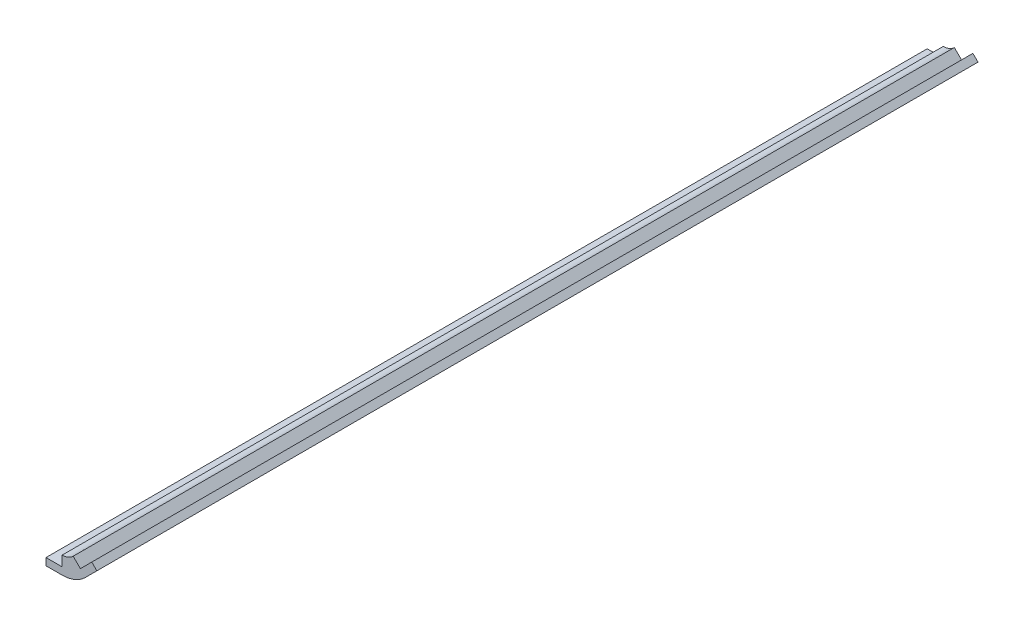
ISO-10303-21;
HEADER;
FILE_DESCRIPTION(('STEP AP214'),'2;1');
FILE_NAME('part.step','',(''),(''),'','','');
FILE_SCHEMA(('AUTOMOTIVE_DESIGN { 1 0 10303 214 1 1 1 1 }'));
ENDSEC;
DATA;
#1=APPLICATION_CONTEXT('core data for automotive mechanical design processes');
#2=APPLICATION_PROTOCOL_DEFINITION('international standard','automotive_design',2000,#1);
#3=PRODUCT_CONTEXT('',#1,'mechanical');
#4=PRODUCT('Part','Part','',(#3));
#5=PRODUCT_RELATED_PRODUCT_CATEGORY('part','',(#4));
#6=PRODUCT_DEFINITION_FORMATION('','',#4);
#7=PRODUCT_DEFINITION_CONTEXT('part definition',#1,'design');
#8=PRODUCT_DEFINITION('design','',#6,#7);
#9=PRODUCT_DEFINITION_SHAPE('','',#8);
#10=(LENGTH_UNIT() NAMED_UNIT(*) SI_UNIT(.MILLI.,.METRE.));
#11=(NAMED_UNIT(*) PLANE_ANGLE_UNIT() SI_UNIT($,.RADIAN.));
#12=(NAMED_UNIT(*) SI_UNIT($,.STERADIAN.) SOLID_ANGLE_UNIT());
#13=UNCERTAINTY_MEASURE_WITH_UNIT(LENGTH_MEASURE(1.E-05),#10,'distance_accuracy_value','');
#14=(GEOMETRIC_REPRESENTATION_CONTEXT(3) GLOBAL_UNCERTAINTY_ASSIGNED_CONTEXT((#13)) GLOBAL_UNIT_ASSIGNED_CONTEXT((#10,
#11,#12)) REPRESENTATION_CONTEXT('',''));
#15=CARTESIAN_POINT('',(0.,0.,0.));
#16=DIRECTION('',(0.,0.,1.));
#17=DIRECTION('',(1.,0.,0.));
#18=AXIS2_PLACEMENT_3D('',#15,#16,#17);
#19=CARTESIAN_POINT('',(-7.3025,-1.500000048,130.175));
#20=DIRECTION('',(1.,0.,0.));
#21=DIRECTION('',(0.,0.,-1.));
#22=AXIS2_PLACEMENT_3D('',#19,#20,#21);
#23=PLANE('',#22);
#24=DIRECTION('',(0.,-1.,0.));
#25=VECTOR('',#24,1.);
#26=CARTESIAN_POINT('',(-7.3025,-1.500000048,-130.175));
#27=LINE('',#26,#25);
#28=CARTESIAN_POINT('',(-7.3025,-1.500000048,-130.175));
#29=VERTEX_POINT('',#28);
#30=CARTESIAN_POINT('',(-7.3025,-3.621225168,-130.175));
#31=VERTEX_POINT('',#30);
#32=EDGE_CURVE('E94',#29,#31,#27,.T.);
#33=ORIENTED_EDGE('',*,*,#32,.T.);
#34=DIRECTION('',(0.,0.,-1.));
#35=VECTOR('',#34,1.);
#36=CARTESIAN_POINT('',(-7.3025,-3.621225168,130.175));
#37=LINE('',#36,#35);
#38=CARTESIAN_POINT('',(-7.3025,-3.621225168,130.175));
#39=VERTEX_POINT('',#38);
#40=EDGE_CURVE('E11',#39,#31,#37,.T.);
#41=ORIENTED_EDGE('',*,*,#40,.F.);
#42=DIRECTION('',(0.,-1.,0.));
#43=VECTOR('',#42,1.);
#44=CARTESIAN_POINT('',(-7.3025,-1.500000048,130.175));
#45=LINE('',#44,#43);
#46=CARTESIAN_POINT('',(-7.3025,-1.500000048,130.175));
#47=VERTEX_POINT('',#46);
#48=EDGE_CURVE('E88',#47,#39,#45,.T.);
#49=ORIENTED_EDGE('',*,*,#48,.F.);
#50=DIRECTION('',(0.,0.,-1.));
#51=VECTOR('',#50,1.);
#52=CARTESIAN_POINT('',(-7.3025,-1.500000048,130.175));
#53=LINE('',#52,#51);
#54=EDGE_CURVE('E83',#47,#29,#53,.T.);
#55=ORIENTED_EDGE('',*,*,#54,.T.);
#56=EDGE_LOOP('',(#33,#41,#49,#55));
#57=FACE_BOUND('',#56,.T.);
#58=ADVANCED_FACE('F40',(#57),#23,.F.);
#59=CARTESIAN_POINT('',(-7.3025,-3.621225168,130.175));
#60=DIRECTION('',(0.,1.,0.));
#61=DIRECTION('',(0.,0.,1.));
#62=AXIS2_PLACEMENT_3D('',#59,#60,#61);
#63=PLANE('',#62);
#64=DIRECTION('',(1.,0.,0.));
#65=VECTOR('',#64,1.);
#66=CARTESIAN_POINT('',(-7.3025,-3.621225168,-130.175));
#67=LINE('',#66,#65);
#68=CARTESIAN_POINT('',(-2.54,-3.621225168,-130.175));
#69=VERTEX_POINT('',#68);
#70=EDGE_CURVE('E89',#31,#69,#67,.T.);
#71=ORIENTED_EDGE('',*,*,#70,.T.);
#72=DIRECTION('',(0.,0.,-1.));
#73=VECTOR('',#72,1.);
#74=CARTESIAN_POINT('',(-2.54,-3.621225168,130.175));
#75=LINE('',#74,#73);
#76=CARTESIAN_POINT('',(-2.54,-3.621225168,130.175));
#77=VERTEX_POINT('',#76);
#78=EDGE_CURVE('E49',#77,#69,#75,.T.);
#79=ORIENTED_EDGE('',*,*,#78,.F.);
#80=DIRECTION('',(1.,0.,0.));
#81=VECTOR('',#80,1.);
#82=CARTESIAN_POINT('',(-7.3025,-3.621225168,130.175));
#83=LINE('',#82,#81);
#84=EDGE_CURVE('E137',#39,#77,#83,.T.);
#85=ORIENTED_EDGE('',*,*,#84,.F.);
#86=ORIENTED_EDGE('',*,*,#40,.T.);
#87=EDGE_LOOP('',(#71,#79,#85,#86));
#88=FACE_BOUND('',#87,.T.);
#89=ADVANCED_FACE('F136',(#88),#63,.F.);
#90=CARTESIAN_POINT('',(-7.3025,-1.500000048,130.175));
#91=DIRECTION('',(0.,-1.,0.));
#92=DIRECTION('',(1.,0.,0.));
#93=AXIS2_PLACEMENT_3D('',#90,#91,#92);
#94=PLANE('',#93);
#95=DIRECTION('',(-1.,0.,0.));
#96=VECTOR('',#95,1.);
#97=CARTESIAN_POINT('',(-7.3025,-1.500000048,-130.175));
#98=LINE('',#97,#96);
#99=CARTESIAN_POINT('',(-2.54,-1.500000048,-130.175));
#100=VERTEX_POINT('',#99);
#101=EDGE_CURVE('E80',#100,#29,#98,.T.);
#102=ORIENTED_EDGE('',*,*,#101,.T.);
#103=ORIENTED_EDGE('',*,*,#54,.F.);
#104=DIRECTION('',(-1.,0.,0.));
#105=VECTOR('',#104,1.);
#106=CARTESIAN_POINT('',(-7.3025,-1.500000048,130.175));
#107=LINE('',#106,#105);
#108=CARTESIAN_POINT('',(-2.54,-1.500000048,130.175));
#109=VERTEX_POINT('',#108);
#110=EDGE_CURVE('E60',#109,#47,#107,.T.);
#111=ORIENTED_EDGE('',*,*,#110,.F.);
#112=DIRECTION('',(0.,0.,-1.));
#113=VECTOR('',#112,1.);
#114=CARTESIAN_POINT('',(-2.54,-1.500000048,130.175));
#115=LINE('',#114,#113);
#116=EDGE_CURVE('E85',#109,#100,#115,.T.);
#117=ORIENTED_EDGE('',*,*,#116,.T.);
#118=EDGE_LOOP('',(#102,#103,#111,#117));
#119=FACE_BOUND('',#118,.T.);
#120=ADVANCED_FACE('F82',(#119),#94,.F.);
#121=CARTESIAN_POINT('',(0.,0.,130.175));
#122=DIRECTION('',(0.,0.,1.));
#123=DIRECTION('',(1.,0.,0.));
#124=AXIS2_PLACEMENT_3D('',#121,#122,#123);
#125=PLANE('',#124);
#126=DIRECTION('',(-0.707106781186546,-0.707106781186549,0.));
#127=VECTOR('',#126,1.);
#128=CARTESIAN_POINT('',(6.2243074753357,4.10298706389383,130.175));
#129=LINE('',#128,#127);
#130=CARTESIAN_POINT('',(6.2243074753357,4.10298706389383,130.175));
#131=VERTEX_POINT('',#130);
#132=CARTESIAN_POINT('',(2.85671142993478,0.73539101849289,130.175));
#133=VERTEX_POINT('',#132);
#134=EDGE_CURVE('E180',#131,#133,#129,.T.);
#135=ORIENTED_EDGE('',*,*,#134,.T.);
#136=DIRECTION('',(-0.707106781186549,0.707106781186546,0.));
#137=VECTOR('',#136,1.);
#138=CARTESIAN_POINT('',(2.85671142993478,0.73539101849289,130.175));
#139=LINE('',#138,#137);
#140=CARTESIAN_POINT('',(0.735391018492879,2.85671142993478,130.175));
#141=VERTEX_POINT('',#140);
#142=EDGE_CURVE('E161',#133,#141,#139,.T.);
#143=ORIENTED_EDGE('',*,*,#142,.T.);
#144=CARTESIAN_POINT('',(-2.54,6.13210244842764,130.175));
#145=DIRECTION('',(0.,0.,-1.));
#146=DIRECTION('',(-1.,0.,0.));
#147=AXIS2_PLACEMENT_3D('',#144,#145,#146);
#148=CIRCLE('',#147,4.63210240042764);
#149=CARTESIAN_POINT('',(-2.54,1.500000048,130.175));
#150=VERTEX_POINT('',#149);
#151=EDGE_CURVE('E165',#141,#150,#148,.T.);
#152=ORIENTED_EDGE('',*,*,#151,.T.);
#153=DIRECTION('',(0.,-1.,0.));
#154=VECTOR('',#153,1.);
#155=CARTESIAN_POINT('',(-2.54,1.500000048,130.175));
#156=LINE('',#155,#154);
#157=EDGE_CURVE('E193',#150,#109,#156,.T.);
#158=ORIENTED_EDGE('',*,*,#157,.T.);
#159=ORIENTED_EDGE('',*,*,#110,.T.);
#160=ORIENTED_EDGE('',*,*,#48,.T.);
#161=ORIENTED_EDGE('',*,*,#84,.T.);
#162=CARTESIAN_POINT('',(-2.54,6.13210244842764,130.175));
#163=DIRECTION('',(0.,0.,1.));
#164=DIRECTION('',(-1.,0.,0.));
#165=AXIS2_PLACEMENT_3D('',#162,#163,#164);
#166=CIRCLE('',#165,9.75332761642764);
#167=CARTESIAN_POINT('',(4.35664409671002,-0.764541648282356,130.175));
#168=VERTEX_POINT('',#167);
#169=EDGE_CURVE('E127',#77,#168,#166,.T.);
#170=ORIENTED_EDGE('',*,*,#169,.T.);
#171=DIRECTION('',(0.707106781186546,0.707106781186549,0.));
#172=VECTOR('',#171,1.);
#173=CARTESIAN_POINT('',(7.72424014211095,2.60305439711859,130.175));
#174=LINE('',#173,#172);
#175=CARTESIAN_POINT('',(7.72424014211095,2.60305439711859,130.175));
#176=VERTEX_POINT('',#175);
#177=EDGE_CURVE('E187',#168,#176,#174,.T.);
#178=ORIENTED_EDGE('',*,*,#177,.T.);
#179=DIRECTION('',(-0.707106781186549,0.707106781186546,0.));
#180=VECTOR('',#179,1.);
#181=CARTESIAN_POINT('',(7.72424014211095,2.60305439711859,130.175));
#182=LINE('',#181,#180);
#183=EDGE_CURVE('E183',#176,#131,#182,.T.);
#184=ORIENTED_EDGE('',*,*,#183,.T.);
#185=EDGE_LOOP('',(#135,#143,#152,#158,#159,#160,#161,#170,#178,#184));
#186=FACE_BOUND('',#185,.T.);
#187=ADVANCED_FACE('F140',(#186),#125,.T.);
#188=CARTESIAN_POINT('',(0.,0.,-130.175));
#189=DIRECTION('',(0.,0.,1.));
#190=DIRECTION('',(1.,0.,0.));
#191=AXIS2_PLACEMENT_3D('',#188,#189,#190);
#192=PLANE('',#191);
#193=DIRECTION('',(0.707106781186546,0.707106781186549,0.));
#194=VECTOR('',#193,1.);
#195=CARTESIAN_POINT('',(7.72424014211095,2.60305439711859,-130.175));
#196=LINE('',#195,#194);
#197=CARTESIAN_POINT('',(4.35664409671002,-0.764541648282356,-130.175));
#198=VERTEX_POINT('',#197);
#199=CARTESIAN_POINT('',(7.72424014211095,2.60305439711859,-130.175));
#200=VERTEX_POINT('',#199);
#201=EDGE_CURVE('E134',#198,#200,#196,.T.);
#202=ORIENTED_EDGE('',*,*,#201,.F.);
#203=CARTESIAN_POINT('',(-2.54,6.13210244842764,-130.175));
#204=DIRECTION('',(0.,0.,1.));
#205=DIRECTION('',(-1.,0.,0.));
#206=AXIS2_PLACEMENT_3D('',#203,#204,#205);
#207=CIRCLE('',#206,9.75332761642764);
#208=EDGE_CURVE('E123',#69,#198,#207,.T.);
#209=ORIENTED_EDGE('',*,*,#208,.F.);
#210=ORIENTED_EDGE('',*,*,#70,.F.);
#211=ORIENTED_EDGE('',*,*,#32,.F.);
#212=ORIENTED_EDGE('',*,*,#101,.F.);
#213=DIRECTION('',(0.,-1.,0.));
#214=VECTOR('',#213,1.);
#215=CARTESIAN_POINT('',(-2.54,1.500000048,-130.175));
#216=LINE('',#215,#214);
#217=CARTESIAN_POINT('',(-2.54,1.500000048,-130.175));
#218=VERTEX_POINT('',#217);
#219=EDGE_CURVE('E75',#218,#100,#216,.T.);
#220=ORIENTED_EDGE('',*,*,#219,.F.);
#221=CARTESIAN_POINT('',(-2.54,6.13210244842764,-130.175));
#222=DIRECTION('',(0.,0.,-1.));
#223=DIRECTION('',(-1.,0.,0.));
#224=AXIS2_PLACEMENT_3D('',#221,#222,#223);
#225=CIRCLE('',#224,4.63210240042764);
#226=CARTESIAN_POINT('',(0.735391018492879,2.85671142993478,-130.175));
#227=VERTEX_POINT('',#226);
#228=EDGE_CURVE('E174',#227,#218,#225,.T.);
#229=ORIENTED_EDGE('',*,*,#228,.F.);
#230=DIRECTION('',(-0.707106781186549,0.707106781186546,0.));
#231=VECTOR('',#230,1.);
#232=CARTESIAN_POINT('',(2.85671142993478,0.73539101849289,-130.175));
#233=LINE('',#232,#231);
#234=CARTESIAN_POINT('',(2.85671142993478,0.73539101849289,-130.175));
#235=VERTEX_POINT('',#234);
#236=EDGE_CURVE('E162',#235,#227,#233,.T.);
#237=ORIENTED_EDGE('',*,*,#236,.F.);
#238=DIRECTION('',(-0.707106781186546,-0.707106781186549,0.));
#239=VECTOR('',#238,1.);
#240=CARTESIAN_POINT('',(6.2243074753357,4.10298706389383,-130.175));
#241=LINE('',#240,#239);
#242=CARTESIAN_POINT('',(6.2243074753357,4.10298706389383,-130.175));
#243=VERTEX_POINT('',#242);
#244=EDGE_CURVE('E166',#243,#235,#241,.T.);
#245=ORIENTED_EDGE('',*,*,#244,.F.);
#246=DIRECTION('',(-0.707106781186549,0.707106781186546,0.));
#247=VECTOR('',#246,1.);
#248=CARTESIAN_POINT('',(7.72424014211095,2.60305439711859,-130.175));
#249=LINE('',#248,#247);
#250=EDGE_CURVE('E169',#200,#243,#249,.T.);
#251=ORIENTED_EDGE('',*,*,#250,.F.);
#252=EDGE_LOOP('',(#202,#209,#210,#211,#212,#220,#229,#237,#245,#251));
#253=FACE_BOUND('',#252,.T.);
#254=ADVANCED_FACE('F98',(#253),#192,.F.);
#255=CARTESIAN_POINT('',(-2.54,6.13210244842764,130.175));
#256=DIRECTION('',(0.,0.,-1.));
#257=DIRECTION('',(-1.,0.,0.));
#258=AXIS2_PLACEMENT_3D('',#255,#256,#257);
#259=CYLINDRICAL_SURFACE('',#258,4.63210240042764);
#260=ORIENTED_EDGE('',*,*,#228,.T.);
#261=DIRECTION('',(0.,0.,-1.));
#262=VECTOR('',#261,1.);
#263=CARTESIAN_POINT('',(-2.54,1.500000048,130.175));
#264=LINE('',#263,#262);
#265=EDGE_CURVE('E101',#150,#218,#264,.T.);
#266=ORIENTED_EDGE('',*,*,#265,.F.);
#267=ORIENTED_EDGE('',*,*,#151,.F.);
#268=DIRECTION('',(0.,0.,-1.));
#269=VECTOR('',#268,1.);
#270=CARTESIAN_POINT('',(0.735391018492879,2.85671142993478,130.175));
#271=LINE('',#270,#269);
#272=EDGE_CURVE('E157',#141,#227,#271,.T.);
#273=ORIENTED_EDGE('',*,*,#272,.T.);
#274=EDGE_LOOP('',(#260,#266,#267,#273));
#275=FACE_BOUND('',#274,.T.);
#276=ADVANCED_FACE('F208',(#275),#259,.F.);
#277=CARTESIAN_POINT('',(-2.54,1.500000048,130.175));
#278=DIRECTION('',(1.,0.,0.));
#279=DIRECTION('',(0.,0.,-1.));
#280=AXIS2_PLACEMENT_3D('',#277,#278,#279);
#281=PLANE('',#280);
#282=ORIENTED_EDGE('',*,*,#219,.T.);
#283=ORIENTED_EDGE('',*,*,#116,.F.);
#284=ORIENTED_EDGE('',*,*,#157,.F.);
#285=ORIENTED_EDGE('',*,*,#265,.T.);
#286=EDGE_LOOP('',(#282,#283,#284,#285));
#287=FACE_BOUND('',#286,.T.);
#288=ADVANCED_FACE('F210',(#287),#281,.F.);
#289=CARTESIAN_POINT('',(-2.54,6.13210244842764,130.175));
#290=DIRECTION('',(0.,0.,-1.));
#291=DIRECTION('',(-1.,0.,0.));
#292=AXIS2_PLACEMENT_3D('',#289,#290,#291);
#293=CYLINDRICAL_SURFACE('',#292,9.75332761642764);
#294=ORIENTED_EDGE('',*,*,#208,.T.);
#295=DIRECTION('',(0.,0.,-1.));
#296=VECTOR('',#295,1.);
#297=CARTESIAN_POINT('',(4.35664409671002,-0.764541648282356,130.175));
#298=LINE('',#297,#296);
#299=EDGE_CURVE('E105',#168,#198,#298,.T.);
#300=ORIENTED_EDGE('',*,*,#299,.F.);
#301=ORIENTED_EDGE('',*,*,#169,.F.);
#302=ORIENTED_EDGE('',*,*,#78,.T.);
#303=EDGE_LOOP('',(#294,#300,#301,#302));
#304=FACE_BOUND('',#303,.T.);
#305=ADVANCED_FACE('F120',(#304),#293,.T.);
#306=CARTESIAN_POINT('',(7.72424014211095,2.60305439711859,130.175));
#307=DIRECTION('',(-0.707106781186549,0.707106781186546,0.));
#308=DIRECTION('',(-0.707106781186546,-0.707106781186549,0.));
#309=AXIS2_PLACEMENT_3D('',#306,#307,#308);
#310=PLANE('',#309);
#311=ORIENTED_EDGE('',*,*,#201,.T.);
#312=DIRECTION('',(0.,0.,-1.));
#313=VECTOR('',#312,1.);
#314=CARTESIAN_POINT('',(7.72424014211095,2.60305439711859,130.175));
#315=LINE('',#314,#313);
#316=EDGE_CURVE('E146',#176,#200,#315,.T.);
#317=ORIENTED_EDGE('',*,*,#316,.F.);
#318=ORIENTED_EDGE('',*,*,#177,.F.);
#319=ORIENTED_EDGE('',*,*,#299,.T.);
#320=EDGE_LOOP('',(#311,#317,#318,#319));
#321=FACE_BOUND('',#320,.T.);
#322=ADVANCED_FACE('F251',(#321),#310,.F.);
#323=CARTESIAN_POINT('',(7.72424014211095,2.60305439711859,130.175));
#324=DIRECTION('',(-0.707106781186546,-0.707106781186549,0.));
#325=DIRECTION('',(0.707106781186549,-0.707106781186546,0.));
#326=AXIS2_PLACEMENT_3D('',#323,#324,#325);
#327=PLANE('',#326);
#328=ORIENTED_EDGE('',*,*,#250,.T.);
#329=DIRECTION('',(0.,0.,-1.));
#330=VECTOR('',#329,1.);
#331=CARTESIAN_POINT('',(6.2243074753357,4.10298706389383,130.175));
#332=LINE('',#331,#330);
#333=EDGE_CURVE('E149',#131,#243,#332,.T.);
#334=ORIENTED_EDGE('',*,*,#333,.F.);
#335=ORIENTED_EDGE('',*,*,#183,.F.);
#336=ORIENTED_EDGE('',*,*,#316,.T.);
#337=EDGE_LOOP('',(#328,#334,#335,#336));
#338=FACE_BOUND('',#337,.T.);
#339=ADVANCED_FACE('F234',(#338),#327,.F.);
#340=CARTESIAN_POINT('',(6.2243074753357,4.10298706389383,130.175));
#341=DIRECTION('',(0.707106781186549,-0.707106781186546,0.));
#342=DIRECTION('',(0.707106781186546,0.707106781186549,0.));
#343=AXIS2_PLACEMENT_3D('',#340,#341,#342);
#344=PLANE('',#343);
#345=ORIENTED_EDGE('',*,*,#244,.T.);
#346=DIRECTION('',(0.,0.,-1.));
#347=VECTOR('',#346,1.);
#348=CARTESIAN_POINT('',(2.85671142993478,0.73539101849289,130.175));
#349=LINE('',#348,#347);
#350=EDGE_CURVE('E153',#133,#235,#349,.T.);
#351=ORIENTED_EDGE('',*,*,#350,.F.);
#352=ORIENTED_EDGE('',*,*,#134,.F.);
#353=ORIENTED_EDGE('',*,*,#333,.T.);
#354=EDGE_LOOP('',(#345,#351,#352,#353));
#355=FACE_BOUND('',#354,.T.);
#356=ADVANCED_FACE('F227',(#355),#344,.F.);
#357=CARTESIAN_POINT('',(2.85671142993478,0.73539101849289,130.175));
#358=DIRECTION('',(-0.707106781186546,-0.707106781186549,0.));
#359=DIRECTION('',(0.707106781186549,-0.707106781186546,0.));
#360=AXIS2_PLACEMENT_3D('',#357,#358,#359);
#361=PLANE('',#360);
#362=ORIENTED_EDGE('',*,*,#236,.T.);
#363=ORIENTED_EDGE('',*,*,#272,.F.);
#364=ORIENTED_EDGE('',*,*,#142,.F.);
#365=ORIENTED_EDGE('',*,*,#350,.T.);
#366=EDGE_LOOP('',(#362,#363,#364,#365));
#367=FACE_BOUND('',#366,.T.);
#368=ADVANCED_FACE('F223',(#367),#361,.F.);
#369=CLOSED_SHELL('',(#58,#89,#120,#187,#254,#276,#288,#305,#322,#339,#356,#368));
#370=MANIFOLD_SOLID_BREP('B2',#369);
#371=ADVANCED_BREP_SHAPE_REPRESENTATION('',(#18,#370),#14);
#372=SHAPE_DEFINITION_REPRESENTATION(#9,#371);
ENDSEC;
END-ISO-10303-21;
